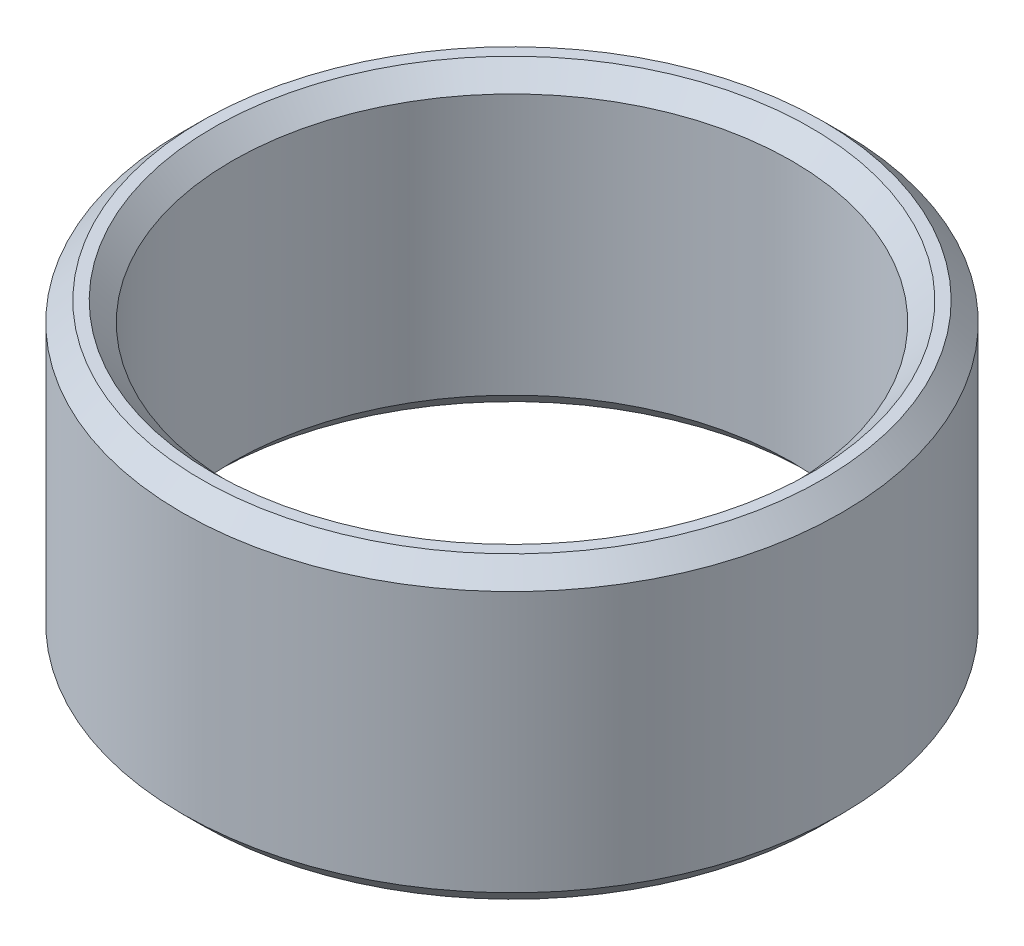
ISO-10303-21;
HEADER;
FILE_DESCRIPTION(('STEP AP214'),'2;1');
FILE_NAME('part.step','',(''),(''),'','','');
FILE_SCHEMA(('AUTOMOTIVE_DESIGN { 1 0 10303 214 1 1 1 1 }'));
ENDSEC;
DATA;
#1=APPLICATION_CONTEXT('core data for automotive mechanical design processes');
#2=APPLICATION_PROTOCOL_DEFINITION('international standard','automotive_design',2000,#1);
#3=PRODUCT_CONTEXT('',#1,'mechanical');
#4=PRODUCT('Part','Part','',(#3));
#5=PRODUCT_RELATED_PRODUCT_CATEGORY('part','',(#4));
#6=PRODUCT_DEFINITION_FORMATION('','',#4);
#7=PRODUCT_DEFINITION_CONTEXT('part definition',#1,'design');
#8=PRODUCT_DEFINITION('design','',#6,#7);
#9=PRODUCT_DEFINITION_SHAPE('','',#8);
#10=(LENGTH_UNIT() NAMED_UNIT(*) SI_UNIT(.MILLI.,.METRE.));
#11=(NAMED_UNIT(*) PLANE_ANGLE_UNIT() SI_UNIT($,.RADIAN.));
#12=(NAMED_UNIT(*) SI_UNIT($,.STERADIAN.) SOLID_ANGLE_UNIT());
#13=UNCERTAINTY_MEASURE_WITH_UNIT(LENGTH_MEASURE(1.E-05),#10,'distance_accuracy_value','');
#14=(GEOMETRIC_REPRESENTATION_CONTEXT(3) GLOBAL_UNCERTAINTY_ASSIGNED_CONTEXT((#13)) GLOBAL_UNIT_ASSIGNED_CONTEXT((#10,
#11,#12)) REPRESENTATION_CONTEXT('',''));
#15=CARTESIAN_POINT('',(0.,0.,0.));
#16=DIRECTION('',(0.,0.,1.));
#17=DIRECTION('',(1.,0.,0.));
#18=AXIS2_PLACEMENT_3D('',#15,#16,#17);
#19=CARTESIAN_POINT('',(0.,27.2182921064719,0.));
#20=DIRECTION('',(0.,-1.,0.));
#21=DIRECTION('',(0.,0.,-1.));
#22=AXIS2_PLACEMENT_3D('',#19,#20,#21);
#23=CYLINDRICAL_SURFACE('',#22,30.);
#24=CARTESIAN_POINT('',(0.,1.74251388383827,0.));
#25=DIRECTION('',(0.,1.,0.));
#26=DIRECTION('',(0.,0.,1.));
#27=AXIS2_PLACEMENT_3D('',#24,#25,#26);
#28=CIRCLE('',#27,30.);
#29=CARTESIAN_POINT('',(0.,1.74251388383827,30.));
#30=VERTEX_POINT('',#29);
#31=EDGE_CURVE('E10',#30,#30,#28,.T.);
#32=ORIENTED_EDGE('',*,*,#31,.T.);
#33=EDGE_LOOP('',(#32));
#34=FACE_BOUND('',#33,.T.);
#35=CARTESIAN_POINT('',(0.,25.4757782226336,0.));
#36=DIRECTION('',(0.,1.,0.));
#37=DIRECTION('',(0.,0.,1.));
#38=AXIS2_PLACEMENT_3D('',#35,#36,#37);
#39=CIRCLE('',#38,30.);
#40=CARTESIAN_POINT('',(0.,25.4757782226336,-30.));
#41=VERTEX_POINT('',#40);
#42=EDGE_CURVE('E50',#41,#41,#39,.F.);
#43=ORIENTED_EDGE('',*,*,#42,.T.);
#44=EDGE_LOOP('',(#43));
#45=FACE_BOUND('',#44,.T.);
#46=ADVANCED_FACE('F39',(#34,#45),#23,.T.);
#47=CARTESIAN_POINT('',(0.,27.2182921064719,0.));
#48=DIRECTION('',(0.,1.,0.));
#49=DIRECTION('',(0.,0.,1.));
#50=AXIS2_PLACEMENT_3D('',#47,#48,#49);
#51=PLANE('',#50);
#52=CARTESIAN_POINT('',(0.,27.2182921064719,0.));
#53=DIRECTION('',(0.,1.,0.));
#54=DIRECTION('',(0.,0.,1.));
#55=AXIS2_PLACEMENT_3D('',#52,#53,#54);
#56=CIRCLE('',#55,27.2048312588971);
#57=CARTESIAN_POINT('',(0.,27.2182921064719,27.2048312588971));
#58=VERTEX_POINT('',#57);
#59=EDGE_CURVE('E58',#58,#58,#56,.F.);
#60=ORIENTED_EDGE('',*,*,#59,.T.);
#61=EDGE_LOOP('',(#60));
#62=FACE_BOUND('',#61,.T.);
#63=CARTESIAN_POINT('',(0.,27.2182921064719,0.));
#64=DIRECTION('',(0.,1.,0.));
#65=DIRECTION('',(0.,0.,1.));
#66=AXIS2_PLACEMENT_3D('',#63,#64,#65);
#67=CIRCLE('',#66,28.2574861161617);
#68=CARTESIAN_POINT('',(0.,27.2182921064719,-28.2574861161617));
#69=VERTEX_POINT('',#68);
#70=EDGE_CURVE('E61',#69,#69,#67,.T.);
#71=ORIENTED_EDGE('',*,*,#70,.T.);
#72=EDGE_LOOP('',(#71));
#73=FACE_BOUND('',#72,.T.);
#74=ADVANCED_FACE('F88',(#62,#73),#51,.T.);
#75=CARTESIAN_POINT('',(0.,0.,0.));
#76=DIRECTION('',(0.,1.,0.));
#77=DIRECTION('',(0.,0.,1.));
#78=AXIS2_PLACEMENT_3D('',#75,#76,#77);
#79=PLANE('',#78);
#80=CARTESIAN_POINT('',(0.,0.,0.));
#81=DIRECTION('',(0.,1.,0.));
#82=DIRECTION('',(0.,0.,1.));
#83=AXIS2_PLACEMENT_3D('',#80,#81,#82);
#84=CIRCLE('',#83,27.2048312588971);
#85=CARTESIAN_POINT('',(0.,0.,27.2048312588971));
#86=VERTEX_POINT('',#85);
#87=EDGE_CURVE('E51',#86,#86,#84,.T.);
#88=ORIENTED_EDGE('',*,*,#87,.T.);
#89=EDGE_LOOP('',(#88));
#90=FACE_BOUND('',#89,.T.);
#91=CARTESIAN_POINT('',(0.,0.,0.));
#92=DIRECTION('',(0.,1.,0.));
#93=DIRECTION('',(0.,0.,1.));
#94=AXIS2_PLACEMENT_3D('',#91,#92,#93);
#95=CIRCLE('',#94,28.2574861161617);
#96=CARTESIAN_POINT('',(0.,0.,28.2574861161617));
#97=VERTEX_POINT('',#96);
#98=EDGE_CURVE('E54',#97,#97,#95,.F.);
#99=ORIENTED_EDGE('',*,*,#98,.T.);
#100=EDGE_LOOP('',(#99));
#101=FACE_BOUND('',#100,.T.);
#102=ADVANCED_FACE('F83',(#90,#101),#79,.F.);
#103=CARTESIAN_POINT('',(0.,27.2182921064719,0.));
#104=DIRECTION('',(0.,-1.,0.));
#105=DIRECTION('',(0.,0.,-1.));
#106=AXIS2_PLACEMENT_3D('',#103,#104,#105);
#107=CYLINDRICAL_SURFACE('',#106,25.4623173750588);
#108=CARTESIAN_POINT('',(0.,25.4757782226336,0.));
#109=DIRECTION('',(0.,1.,0.));
#110=DIRECTION('',(0.,0.,1.));
#111=AXIS2_PLACEMENT_3D('',#108,#109,#110);
#112=CIRCLE('',#111,25.4623173750588);
#113=CARTESIAN_POINT('',(0.,25.4757782226336,25.4623173750588));
#114=VERTEX_POINT('',#113);
#115=EDGE_CURVE('E67',#114,#114,#112,.T.);
#116=ORIENTED_EDGE('',*,*,#115,.T.);
#117=EDGE_LOOP('',(#116));
#118=FACE_BOUND('',#117,.T.);
#119=CARTESIAN_POINT('',(0.,1.74251388383831,0.));
#120=DIRECTION('',(0.,1.,0.));
#121=DIRECTION('',(0.,0.,1.));
#122=AXIS2_PLACEMENT_3D('',#119,#120,#121);
#123=CIRCLE('',#122,25.4623173750588);
#124=CARTESIAN_POINT('',(0.,1.74251388383831,25.4623173750588));
#125=VERTEX_POINT('',#124);
#126=EDGE_CURVE('E69',#125,#125,#123,.F.);
#127=ORIENTED_EDGE('',*,*,#126,.T.);
#128=EDGE_LOOP('',(#127));
#129=FACE_BOUND('',#128,.T.);
#130=ADVANCED_FACE('F71',(#118,#129),#107,.F.);
#131=CARTESIAN_POINT('',(0.,25.4757782226336,0.));
#132=DIRECTION('',(0.,1.,0.));
#133=DIRECTION('',(0.,0.,1.));
#134=AXIS2_PLACEMENT_3D('',#131,#132,#133);
#135=CONICAL_SURFACE('',#134,25.4623173750588,0.78539816339745);
#136=ORIENTED_EDGE('',*,*,#59,.F.);
#137=EDGE_LOOP('',(#136));
#138=FACE_BOUND('',#137,.T.);
#139=ORIENTED_EDGE('',*,*,#115,.F.);
#140=EDGE_LOOP('',(#139));
#141=FACE_BOUND('',#140,.T.);
#142=ADVANCED_FACE('F77',(#138,#141),#135,.F.);
#143=CARTESIAN_POINT('',(0.,0.,0.));
#144=DIRECTION('',(0.,-1.,0.));
#145=DIRECTION('',(0.,0.,-1.));
#146=AXIS2_PLACEMENT_3D('',#143,#144,#145);
#147=CONICAL_SURFACE('',#146,27.2048312588971,0.785398163397441);
#148=ORIENTED_EDGE('',*,*,#126,.F.);
#149=EDGE_LOOP('',(#148));
#150=FACE_BOUND('',#149,.T.);
#151=ORIENTED_EDGE('',*,*,#87,.F.);
#152=EDGE_LOOP('',(#151));
#153=FACE_BOUND('',#152,.T.);
#154=ADVANCED_FACE('F73',(#150,#153),#147,.F.);
#155=CARTESIAN_POINT('',(0.,1.74251388383827,0.));
#156=DIRECTION('',(0.,1.,0.));
#157=DIRECTION('',(0.,0.,1.));
#158=AXIS2_PLACEMENT_3D('',#155,#156,#157);
#159=CONICAL_SURFACE('',#158,30.,0.785398163397454);
#160=ORIENTED_EDGE('',*,*,#98,.F.);
#161=EDGE_LOOP('',(#160));
#162=FACE_BOUND('',#161,.T.);
#163=ORIENTED_EDGE('',*,*,#31,.F.);
#164=EDGE_LOOP('',(#163));
#165=FACE_BOUND('',#164,.T.);
#166=ADVANCED_FACE('F76',(#162,#165),#159,.T.);
#167=CARTESIAN_POINT('',(0.,27.2182921064719,0.));
#168=DIRECTION('',(0.,-1.,0.));
#169=DIRECTION('',(0.,0.,-1.));
#170=AXIS2_PLACEMENT_3D('',#167,#168,#169);
#171=CONICAL_SURFACE('',#170,28.2574861161617,0.785398163397448);
#172=CARTESIAN_POINT('',(0.,25.4757782226336,-30.));
#173=CARTESIAN_POINT('',(0.,25.4939294089236,-29.98184881371));
#174=CARTESIAN_POINT('',(0.,25.5120805952136,-29.96369762742));
#175=CARTESIAN_POINT('',(0.,25.5483829677936,-29.9273952548401));
#176=CARTESIAN_POINT('',(0.,25.5665341540835,-29.9092440685501));
#177=CARTESIAN_POINT('',(0.,25.6028365266635,-29.8729416959701));
#178=CARTESIAN_POINT('',(0.,25.6209877129535,-29.8547905096801));
#179=CARTESIAN_POINT('',(0.,25.6572900855334,-29.8184881371002));
#180=CARTESIAN_POINT('',(0.,25.6754412718234,-29.8003369508102));
#181=CARTESIAN_POINT('',(0.,25.7117436444034,-29.7640345782302));
#182=CARTESIAN_POINT('',(0.,25.7298948306934,-29.7458833919403));
#183=CARTESIAN_POINT('',(0.,25.7661972032733,-29.7095810193603));
#184=CARTESIAN_POINT('',(0.,25.7843483895633,-29.6914298330703));
#185=CARTESIAN_POINT('',(0.,25.8206507621433,-29.6551274604903));
#186=CARTESIAN_POINT('',(0.,25.8388019484333,-29.6369762742004));
#187=CARTESIAN_POINT('',(0.,25.8751043210132,-29.6006739016204));
#188=CARTESIAN_POINT('',(0.,25.8932555073032,-29.5825227153304));
#189=CARTESIAN_POINT('',(0.,25.9295578798832,-29.5462203427505));
#190=CARTESIAN_POINT('',(0.,25.9477090661732,-29.5280691564605));
#191=CARTESIAN_POINT('',(0.,25.9840114387531,-29.4917667838805));
#192=CARTESIAN_POINT('',(0.,26.0021626250431,-29.4736155975905));
#193=CARTESIAN_POINT('',(0.,26.0384649976231,-29.4373132250106));
#194=CARTESIAN_POINT('',(0.,26.0566161839131,-29.4191620387206));
#195=CARTESIAN_POINT('',(0.,26.092918556493,-29.3828596661406));
#196=CARTESIAN_POINT('',(0.,26.111069742783,-29.3647084798506));
#197=CARTESIAN_POINT('',(0.,26.147372115363,-29.3284061072707));
#198=CARTESIAN_POINT('',(0.,26.165523301653,-29.3102549209807));
#199=CARTESIAN_POINT('',(0.,26.2018256742329,-29.2739525484007));
#200=CARTESIAN_POINT('',(0.,26.2199768605229,-29.2558013621107));
#201=CARTESIAN_POINT('',(0.,26.2562792331029,-29.2194989895308));
#202=CARTESIAN_POINT('',(0.,26.2744304193928,-29.2013478032408));
#203=CARTESIAN_POINT('',(0.,26.3107327919728,-29.1650454306608));
#204=CARTESIAN_POINT('',(0.,26.3288839782628,-29.1468942443708));
#205=CARTESIAN_POINT('',(0.,26.3651863508427,-29.1105918717909));
#206=CARTESIAN_POINT('',(0.,26.3833375371327,-29.0924406855009));
#207=CARTESIAN_POINT('',(0.,26.4196399097127,-29.0561383129209));
#208=CARTESIAN_POINT('',(0.,26.4377910960027,-29.0379871266309));
#209=CARTESIAN_POINT('',(0.,26.4740934685826,-29.001684754051));
#210=CARTESIAN_POINT('',(0.,26.4922446548726,-28.983533567761));
#211=CARTESIAN_POINT('',(0.,26.5285470274526,-28.947231195181));
#212=CARTESIAN_POINT('',(0.,26.5466982137426,-28.9290800088911));
#213=CARTESIAN_POINT('',(0.,26.5830005863225,-28.8927776363111));
#214=CARTESIAN_POINT('',(0.,26.6011517726125,-28.8746264500211));
#215=CARTESIAN_POINT('',(0.,26.6374541451925,-28.8383240774412));
#216=CARTESIAN_POINT('',(0.,26.6556053314825,-28.8201728911512));
#217=CARTESIAN_POINT('',(0.,26.6919077040624,-28.7838705185712));
#218=CARTESIAN_POINT('',(0.,26.7100588903524,-28.7657193322812));
#219=CARTESIAN_POINT('',(0.,26.7463612629324,-28.7294169597013));
#220=CARTESIAN_POINT('',(0.,26.7645124492224,-28.7112657734113));
#221=CARTESIAN_POINT('',(0.,26.8008148218023,-28.6749634008313));
#222=CARTESIAN_POINT('',(0.,26.8189660080923,-28.6568122145413));
#223=CARTESIAN_POINT('',(0.,26.8552683806723,-28.6205098419614));
#224=CARTESIAN_POINT('',(0.,26.8734195669623,-28.6023586556714));
#225=CARTESIAN_POINT('',(0.,26.9097219395422,-28.5660562830914));
#226=CARTESIAN_POINT('',(0.,26.9278731258322,-28.5479050968014));
#227=CARTESIAN_POINT('',(0.,26.9641754984122,-28.5116027242215));
#228=CARTESIAN_POINT('',(0.,26.9823266847021,-28.4934515379315));
#229=CARTESIAN_POINT('',(0.,27.0186290572821,-28.4571491653515));
#230=CARTESIAN_POINT('',(0.,27.0367802435721,-28.4389979790615));
#231=CARTESIAN_POINT('',(0.,27.0730826161521,-28.4026956064816));
#232=CARTESIAN_POINT('',(0.,27.091233802442,-28.3845444201916));
#233=CARTESIAN_POINT('',(0.,27.127536175022,-28.3482420476116));
#234=CARTESIAN_POINT('',(0.,27.145687361312,-28.3300908613216));
#235=CARTESIAN_POINT('',(0.,27.1819897338919,-28.2937884887417));
#236=CARTESIAN_POINT('',(0.,27.2001409201819,-28.2756373024517));
#237=CARTESIAN_POINT('',(0.,27.2182921064719,-28.2574861161617));
#238=B_SPLINE_CURVE_WITH_KNOTS('',3,(#172,#173,#174,#175,#176,#177,#178,#179,#180,#181,#182,
#183,#184,#185,#186,#187,#188,#189,#190,#191,#192,#193,#194,#195,#196,#197,#198,#199,#200,#201,
#202,#203,#204,#205,#206,#207,#208,#209,#210,#211,#212,#213,#214,#215,#216,#217,#218,#219,#220,
#221,#222,#223,#224,#225,#226,#227,#228,#229,#230,#231,#232,#233,#234,#235,#236,#237),
.UNSPECIFIED.,.F.,.F.,(4,2,2,2,2,2,2,2,2,2,2,2,2,2,2,2,2,2,2,2,2,2,2,2,2,2,2,2,2,2,2,2,4),(0.,
0.0770089614733598,0.15401792294672,0.231026884420079,0.308035845893439,0.385044807366799,
0.462053768840159,0.539062730313518,0.616071691786878,0.693080653260238,0.770089614733598,
0.847098576206958,0.92410753768032,1.00111649915368,1.07812546062704,1.1551344221004,
1.23214338357376,1.30915234504712,1.38616130652048,1.46317026799384,1.5401792294672,
1.61718819094056,1.69419715241392,1.77120611388728,1.84821507536064,1.925224036834,
2.00223299830736,2.07924195978072,2.15625092125408,2.23325988272744,2.3102688442008,
2.38727780567416,2.46428676714752),.UNSPECIFIED.);
#239=EDGE_CURVE('BSEAM45',#41,#69,#238,.T.);
#240=ORIENTED_EDGE('',*,*,#42,.F.);
#241=ORIENTED_EDGE('',*,*,#70,.F.);
#242=ORIENTED_EDGE('',*,*,#239,.T.);
#243=ORIENTED_EDGE('',*,*,#239,.F.);
#244=EDGE_LOOP('',(#240,#242,#241,#243));
#245=FACE_BOUND('',#244,.T.);
#246=ADVANCED_FACE('F45',(#245),#171,.T.);
#247=CLOSED_SHELL('',(#46,#74,#102,#130,#142,#154,#166,#246));
#248=MANIFOLD_SOLID_BREP('B2',#247);
#249=ADVANCED_BREP_SHAPE_REPRESENTATION('',(#18,#248),#14);
#250=SHAPE_DEFINITION_REPRESENTATION(#9,#249);
ENDSEC;
END-ISO-10303-21;
